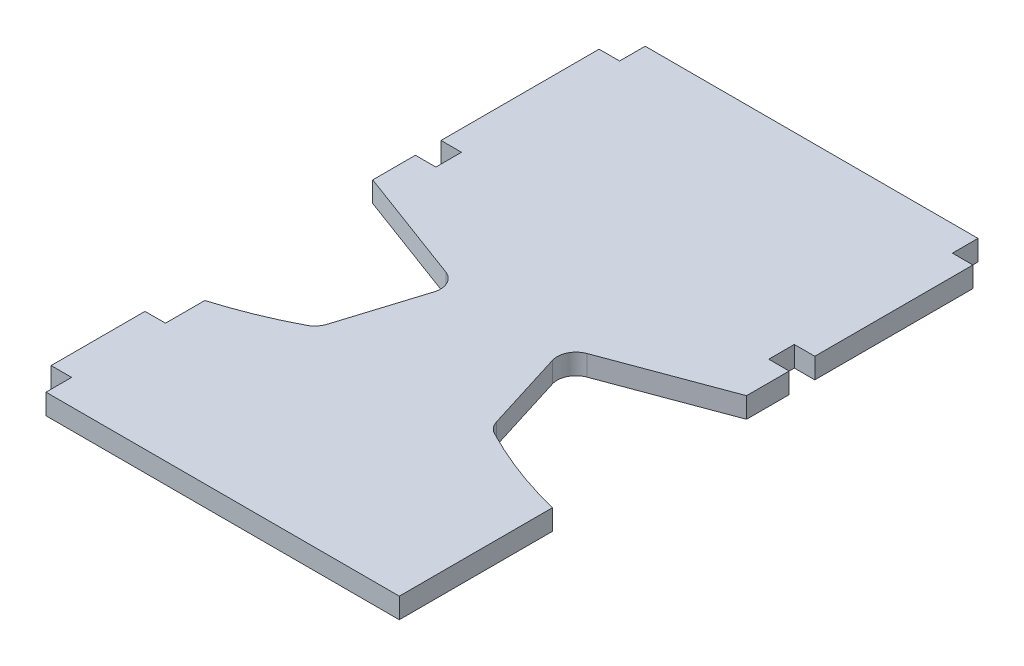
ISO-10303-21;
HEADER;
FILE_DESCRIPTION(('STEP AP214'),'2;1');
FILE_NAME('part.step','',(''),(''),'','','');
FILE_SCHEMA(('AUTOMOTIVE_DESIGN { 1 0 10303 214 1 1 1 1 }'));
ENDSEC;
DATA;
#1=APPLICATION_CONTEXT('core data for automotive mechanical design processes');
#2=APPLICATION_PROTOCOL_DEFINITION('international standard','automotive_design',2000,#1);
#3=PRODUCT_CONTEXT('',#1,'mechanical');
#4=PRODUCT('Part','Part','',(#3));
#5=PRODUCT_RELATED_PRODUCT_CATEGORY('part','',(#4));
#6=PRODUCT_DEFINITION_FORMATION('','',#4);
#7=PRODUCT_DEFINITION_CONTEXT('part definition',#1,'design');
#8=PRODUCT_DEFINITION('design','',#6,#7);
#9=PRODUCT_DEFINITION_SHAPE('','',#8);
#10=(LENGTH_UNIT() NAMED_UNIT(*) SI_UNIT(.MILLI.,.METRE.));
#11=(NAMED_UNIT(*) PLANE_ANGLE_UNIT() SI_UNIT($,.RADIAN.));
#12=(NAMED_UNIT(*) SI_UNIT($,.STERADIAN.) SOLID_ANGLE_UNIT());
#13=UNCERTAINTY_MEASURE_WITH_UNIT(LENGTH_MEASURE(1.E-05),#10,'distance_accuracy_value','');
#14=(GEOMETRIC_REPRESENTATION_CONTEXT(3) GLOBAL_UNCERTAINTY_ASSIGNED_CONTEXT((#13)) GLOBAL_UNIT_ASSIGNED_CONTEXT((#10,
#11,#12)) REPRESENTATION_CONTEXT('',''));
#15=CARTESIAN_POINT('',(0.,0.,0.));
#16=DIRECTION('',(0.,0.,1.));
#17=DIRECTION('',(1.,0.,0.));
#18=AXIS2_PLACEMENT_3D('',#15,#16,#17);
#19=CARTESIAN_POINT('',(55.626,3.048,87.022365809496));
#20=DIRECTION('',(-1.,0.,0.));
#21=DIRECTION('',(0.,0.,1.));
#22=AXIS2_PLACEMENT_3D('',#19,#20,#21);
#23=PLANE('',#22);
#24=DIRECTION('',(0.,0.,-1.));
#25=VECTOR('',#24,1.);
#26=CARTESIAN_POINT('',(55.626,-3.048,87.022365809496));
#27=LINE('',#26,#25);
#28=CARTESIAN_POINT('',(55.626,-3.048,132.617292876109));
#29=VERTEX_POINT('',#28);
#30=CARTESIAN_POINT('',(55.626,-3.048,87.0223658094959));
#31=VERTEX_POINT('',#30);
#32=EDGE_CURVE('E273',#29,#31,#27,.T.);
#33=ORIENTED_EDGE('',*,*,#32,.T.);
#34=DIRECTION('',(0.,-1.,0.));
#35=VECTOR('',#34,1.);
#36=CARTESIAN_POINT('',(55.626,3.048,87.0223658094959));
#37=LINE('',#36,#35);
#38=CARTESIAN_POINT('',(55.626,3.048,87.0223658094959));
#39=VERTEX_POINT('',#38);
#40=EDGE_CURVE('E11',#39,#31,#37,.T.);
#41=ORIENTED_EDGE('',*,*,#40,.F.);
#42=DIRECTION('',(0.,0.,-1.));
#43=VECTOR('',#42,1.);
#44=CARTESIAN_POINT('',(55.626,3.048,87.022365809496));
#45=LINE('',#44,#43);
#46=CARTESIAN_POINT('',(55.626,3.048,132.617292876109));
#47=VERTEX_POINT('',#46);
#48=EDGE_CURVE('E335',#47,#39,#45,.T.);
#49=ORIENTED_EDGE('',*,*,#48,.F.);
#50=DIRECTION('',(0.,-1.,0.));
#51=VECTOR('',#50,1.);
#52=CARTESIAN_POINT('',(55.626,3.048,132.617292876109));
#53=LINE('',#52,#51);
#54=EDGE_CURVE('E269',#47,#29,#53,.T.);
#55=ORIENTED_EDGE('',*,*,#54,.T.);
#56=EDGE_LOOP('',(#33,#41,#49,#55));
#57=FACE_BOUND('',#56,.T.);
#58=ADVANCED_FACE('F33',(#57),#23,.F.);
#59=CARTESIAN_POINT('',(85.09,3.048,-33.02));
#60=DIRECTION('',(0.,-1.,0.));
#61=DIRECTION('',(0.,0.,-1.));
#62=AXIS2_PLACEMENT_3D('',#59,#60,#61);
#63=CYLINDRICAL_SURFACE('',#62,123.605407993101);
#64=CARTESIAN_POINT('',(85.09,-3.048,-33.02));
#65=DIRECTION('',(0.,-1.,0.));
#66=DIRECTION('',(0.,0.,1.));
#67=AXIS2_PLACEMENT_3D('',#64,#65,#66);
#68=CIRCLE('',#67,123.605407993101);
#69=CARTESIAN_POINT('',(27.9390638776405,-3.048,76.5795774876839));
#70=VERTEX_POINT('',#69);
#71=EDGE_CURVE('E276',#31,#70,#68,.T.);
#72=ORIENTED_EDGE('',*,*,#71,.T.);
#73=DIRECTION('',(0.,-1.,0.));
#74=VECTOR('',#73,1.);
#75=CARTESIAN_POINT('',(27.9390638776405,3.048,76.5795774876839));
#76=LINE('',#75,#74);
#77=CARTESIAN_POINT('',(27.9390638776405,3.048,76.5795774876839));
#78=VERTEX_POINT('',#77);
#79=EDGE_CURVE('E41',#78,#70,#76,.T.);
#80=ORIENTED_EDGE('',*,*,#79,.F.);
#81=CARTESIAN_POINT('',(85.09,3.048,-33.02));
#82=DIRECTION('',(0.,-1.,0.));
#83=DIRECTION('',(0.,0.,1.));
#84=AXIS2_PLACEMENT_3D('',#81,#82,#83);
#85=CIRCLE('',#84,123.605407993101);
#86=EDGE_CURVE('E164',#39,#78,#85,.T.);
#87=ORIENTED_EDGE('',*,*,#86,.F.);
#88=ORIENTED_EDGE('',*,*,#40,.T.);
#89=EDGE_LOOP('',(#72,#80,#87,#88));
#90=FACE_BOUND('',#89,.T.);
#91=ADVANCED_FACE('F513',(#90),#63,.F.);
#92=CARTESIAN_POINT('',(30.5227649974942,3.048,71.6247583665386));
#93=DIRECTION('',(0.,-1.,0.));
#94=DIRECTION('',(0.,0.,-1.));
#95=AXIS2_PLACEMENT_3D('',#92,#93,#94);
#96=CYLINDRICAL_SURFACE('',#95,5.588);
#97=CARTESIAN_POINT('',(30.5227649974942,-3.048,71.6247583665386));
#98=DIRECTION('',(0.,-1.,0.));
#99=DIRECTION('',(0.,0.,1.));
#100=AXIS2_PLACEMENT_3D('',#97,#98,#99);
#101=CIRCLE('',#100,5.588);
#102=CARTESIAN_POINT('',(25.187729855607,-3.048,73.2870291130867));
#103=VERTEX_POINT('',#102);
#104=EDGE_CURVE('E278',#70,#103,#101,.T.);
#105=ORIENTED_EDGE('',*,*,#104,.T.);
#106=DIRECTION('',(0.,-1.,0.));
#107=VECTOR('',#106,1.);
#108=CARTESIAN_POINT('',(25.187729855607,3.048,73.2870291130867));
#109=LINE('',#108,#107);
#110=CARTESIAN_POINT('',(25.187729855607,3.048,73.2870291130867));
#111=VERTEX_POINT('',#110);
#112=EDGE_CURVE('E414',#111,#103,#109,.T.);
#113=ORIENTED_EDGE('',*,*,#112,.F.);
#114=CARTESIAN_POINT('',(30.5227649974942,3.048,71.6247583665386));
#115=DIRECTION('',(0.,-1.,0.));
#116=DIRECTION('',(0.,0.,1.));
#117=AXIS2_PLACEMENT_3D('',#114,#115,#116);
#118=CIRCLE('',#117,5.588);
#119=EDGE_CURVE('E422',#78,#111,#118,.T.);
#120=ORIENTED_EDGE('',*,*,#119,.F.);
#121=ORIENTED_EDGE('',*,*,#79,.T.);
#122=EDGE_LOOP('',(#105,#113,#120,#121));
#123=FACE_BOUND('',#122,.T.);
#124=ADVANCED_FACE('F420',(#123),#96,.F.);
#125=CARTESIAN_POINT('',(17.6319537349341,3.048,49.0368693772361));
#126=DIRECTION('',(-0.954730698261834,0.,0.297471500813893));
#127=DIRECTION('',(0.297471500813893,0.,0.954730698261835));
#128=AXIS2_PLACEMENT_3D('',#125,#126,#127);
#129=PLANE('',#128);
#130=DIRECTION('',(-0.297471500813893,0.,-0.954730698261834));
#131=VECTOR('',#130,1.);
#132=CARTESIAN_POINT('',(17.6319537349341,-3.048,49.0368693772361));
#133=LINE('',#132,#131);
#134=CARTESIAN_POINT('',(17.6319537349341,-3.048,49.0368693772361));
#135=VERTEX_POINT('',#134);
#136=EDGE_CURVE('E280',#103,#135,#133,.T.);
#137=ORIENTED_EDGE('',*,*,#136,.T.);
#138=DIRECTION('',(0.,-1.,0.));
#139=VECTOR('',#138,1.);
#140=CARTESIAN_POINT('',(17.6319537349341,3.048,49.0368693772361));
#141=LINE('',#140,#139);
#142=CARTESIAN_POINT('',(17.6319537349341,3.048,49.0368693772361));
#143=VERTEX_POINT('',#142);
#144=EDGE_CURVE('E411',#143,#135,#141,.T.);
#145=ORIENTED_EDGE('',*,*,#144,.F.);
#146=DIRECTION('',(-0.297471500813893,0.,-0.954730698261834));
#147=VECTOR('',#146,1.);
#148=CARTESIAN_POINT('',(17.6319537349341,3.048,49.0368693772361));
#149=LINE('',#148,#147);
#150=EDGE_CURVE('E440',#111,#143,#149,.T.);
#151=ORIENTED_EDGE('',*,*,#150,.F.);
#152=ORIENTED_EDGE('',*,*,#112,.T.);
#153=EDGE_LOOP('',(#137,#145,#151,#152));
#154=FACE_BOUND('',#153,.T.);
#155=ADVANCED_FACE('F431',(#154),#129,.F.);
#156=CARTESIAN_POINT('',(22.9669888768213,3.048,47.374598630688));
#157=DIRECTION('',(0.,-1.,0.));
#158=DIRECTION('',(0.,0.,-1.));
#159=AXIS2_PLACEMENT_3D('',#156,#157,#158);
#160=CYLINDRICAL_SURFACE('',#159,5.588);
#161=CARTESIAN_POINT('',(22.9669888768213,-3.048,47.374598630688));
#162=DIRECTION('',(0.,-1.,0.));
#163=DIRECTION('',(0.,0.,1.));
#164=AXIS2_PLACEMENT_3D('',#161,#162,#163);
#165=CIRCLE('',#164,5.588);
#166=CARTESIAN_POINT('',(21.0198271357508,-3.048,42.1368218929766));
#167=VERTEX_POINT('',#166);
#168=EDGE_CURVE('E282',#135,#167,#165,.T.);
#169=ORIENTED_EDGE('',*,*,#168,.T.);
#170=DIRECTION('',(0.,-1.,0.));
#171=VECTOR('',#170,1.);
#172=CARTESIAN_POINT('',(21.0198271357508,3.048,42.1368218929766));
#173=LINE('',#172,#171);
#174=CARTESIAN_POINT('',(21.0198271357508,3.048,42.1368218929766));
#175=VERTEX_POINT('',#174);
#176=EDGE_CURVE('E408',#175,#167,#173,.T.);
#177=ORIENTED_EDGE('',*,*,#176,.F.);
#178=CARTESIAN_POINT('',(22.9669888768213,3.048,47.374598630688));
#179=DIRECTION('',(0.,-1.,0.));
#180=DIRECTION('',(0.,0.,1.));
#181=AXIS2_PLACEMENT_3D('',#178,#179,#180);
#182=CIRCLE('',#181,5.588);
#183=EDGE_CURVE('E437',#143,#175,#182,.T.);
#184=ORIENTED_EDGE('',*,*,#183,.F.);
#185=ORIENTED_EDGE('',*,*,#144,.T.);
#186=EDGE_LOOP('',(#169,#177,#184,#185));
#187=FACE_BOUND('',#186,.T.);
#188=ADVANCED_FACE('F435',(#187),#160,.F.);
#189=CARTESIAN_POINT('',(55.626,3.048,29.2718566261337));
#190=DIRECTION('',(-0.348454141208024,0.,-0.93732582994121));
#191=DIRECTION('',(-0.93732582994121,0.,0.348454141208024));
#192=AXIS2_PLACEMENT_3D('',#189,#190,#191);
#193=PLANE('',#192);
#194=DIRECTION('',(0.93732582994121,0.,-0.348454141208024));
#195=VECTOR('',#194,1.);
#196=CARTESIAN_POINT('',(55.626,-3.048,29.2718566261337));
#197=LINE('',#196,#195);
#198=CARTESIAN_POINT('',(55.626,-3.048,29.2718566261337));
#199=VERTEX_POINT('',#198);
#200=EDGE_CURVE('E284',#167,#199,#197,.T.);
#201=ORIENTED_EDGE('',*,*,#200,.T.);
#202=DIRECTION('',(0.,-1.,0.));
#203=VECTOR('',#202,1.);
#204=CARTESIAN_POINT('',(55.626,3.048,29.2718566261337));
#205=LINE('',#204,#203);
#206=CARTESIAN_POINT('',(55.626,3.048,29.2718566261337));
#207=VERTEX_POINT('',#206);
#208=EDGE_CURVE('E405',#207,#199,#205,.T.);
#209=ORIENTED_EDGE('',*,*,#208,.F.);
#210=DIRECTION('',(0.93732582994121,0.,-0.348454141208024));
#211=VECTOR('',#210,1.);
#212=CARTESIAN_POINT('',(55.626,3.048,29.2718566261337));
#213=LINE('',#212,#211);
#214=EDGE_CURVE('E439',#175,#207,#213,.T.);
#215=ORIENTED_EDGE('',*,*,#214,.F.);
#216=ORIENTED_EDGE('',*,*,#176,.T.);
#217=EDGE_LOOP('',(#201,#209,#215,#216));
#218=FACE_BOUND('',#217,.T.);
#219=ADVANCED_FACE('F526',(#218),#193,.F.);
#220=CARTESIAN_POINT('',(55.626,3.048,16.5718566261337));
#221=DIRECTION('',(-1.,0.,0.));
#222=DIRECTION('',(0.,0.,1.));
#223=AXIS2_PLACEMENT_3D('',#220,#221,#222);
#224=PLANE('',#223);
#225=DIRECTION('',(0.,0.,-1.));
#226=VECTOR('',#225,1.);
#227=CARTESIAN_POINT('',(55.626,-3.048,16.5718566261337));
#228=LINE('',#227,#226);
#229=CARTESIAN_POINT('',(55.626,-3.048,16.5718566261337));
#230=VERTEX_POINT('',#229);
#231=EDGE_CURVE('E286',#199,#230,#228,.T.);
#232=ORIENTED_EDGE('',*,*,#231,.T.);
#233=DIRECTION('',(0.,-1.,0.));
#234=VECTOR('',#233,1.);
#235=CARTESIAN_POINT('',(55.626,3.048,16.5718566261337));
#236=LINE('',#235,#234);
#237=CARTESIAN_POINT('',(55.626,3.048,16.5718566261337));
#238=VERTEX_POINT('',#237);
#239=EDGE_CURVE('E402',#238,#230,#236,.T.);
#240=ORIENTED_EDGE('',*,*,#239,.F.);
#241=DIRECTION('',(0.,0.,-1.));
#242=VECTOR('',#241,1.);
#243=CARTESIAN_POINT('',(55.626,3.048,16.5718566261337));
#244=LINE('',#243,#242);
#245=EDGE_CURVE('E442',#207,#238,#244,.T.);
#246=ORIENTED_EDGE('',*,*,#245,.F.);
#247=ORIENTED_EDGE('',*,*,#208,.T.);
#248=EDGE_LOOP('',(#232,#240,#246,#247));
#249=FACE_BOUND('',#248,.T.);
#250=ADVANCED_FACE('F529',(#249),#224,.F.);
#251=CARTESIAN_POINT('',(55.626,3.048,16.5718566261337));
#252=DIRECTION('',(0.,0.,1.));
#253=DIRECTION('',(1.,0.,0.));
#254=AXIS2_PLACEMENT_3D('',#251,#252,#253);
#255=PLANE('',#254);
#256=DIRECTION('',(-1.,0.,0.));
#257=VECTOR('',#256,1.);
#258=CARTESIAN_POINT('',(55.626,-3.048,16.5718566261337));
#259=LINE('',#258,#257);
#260=CARTESIAN_POINT('',(49.53,-3.048,16.5718566261337));
#261=VERTEX_POINT('',#260);
#262=EDGE_CURVE('E288',#230,#261,#259,.T.);
#263=ORIENTED_EDGE('',*,*,#262,.T.);
#264=DIRECTION('',(0.,-1.,0.));
#265=VECTOR('',#264,1.);
#266=CARTESIAN_POINT('',(49.53,3.048,16.5718566261337));
#267=LINE('',#266,#265);
#268=CARTESIAN_POINT('',(49.53,3.048,16.5718566261337));
#269=VERTEX_POINT('',#268);
#270=EDGE_CURVE('E399',#269,#261,#267,.T.);
#271=ORIENTED_EDGE('',*,*,#270,.F.);
#272=DIRECTION('',(-1.,0.,0.));
#273=VECTOR('',#272,1.);
#274=CARTESIAN_POINT('',(55.626,3.048,16.5718566261337));
#275=LINE('',#274,#273);
#276=EDGE_CURVE('E448',#238,#269,#275,.T.);
#277=ORIENTED_EDGE('',*,*,#276,.F.);
#278=ORIENTED_EDGE('',*,*,#239,.T.);
#279=EDGE_LOOP('',(#263,#271,#277,#278));
#280=FACE_BOUND('',#279,.T.);
#281=ADVANCED_FACE('F533',(#280),#255,.F.);
#282=CARTESIAN_POINT('',(49.53,3.048,16.5718566261337));
#283=DIRECTION('',(-1.,0.,0.));
#284=DIRECTION('',(0.,0.,1.));
#285=AXIS2_PLACEMENT_3D('',#282,#283,#284);
#286=PLANE('',#285);
#287=DIRECTION('',(0.,0.,-1.));
#288=VECTOR('',#287,1.);
#289=CARTESIAN_POINT('',(49.53,-3.048,16.5718566261337));
#290=LINE('',#289,#288);
#291=CARTESIAN_POINT('',(49.53,-3.048,8.95185662613366));
#292=VERTEX_POINT('',#291);
#293=EDGE_CURVE('E290',#261,#292,#290,.T.);
#294=ORIENTED_EDGE('',*,*,#293,.T.);
#295=DIRECTION('',(0.,-1.,0.));
#296=VECTOR('',#295,1.);
#297=CARTESIAN_POINT('',(49.53,3.048,8.95185662613366));
#298=LINE('',#297,#296);
#299=CARTESIAN_POINT('',(49.53,3.048,8.95185662613366));
#300=VERTEX_POINT('',#299);
#301=EDGE_CURVE('E396',#300,#292,#298,.T.);
#302=ORIENTED_EDGE('',*,*,#301,.F.);
#303=DIRECTION('',(0.,0.,-1.));
#304=VECTOR('',#303,1.);
#305=CARTESIAN_POINT('',(49.53,3.048,16.5718566261337));
#306=LINE('',#305,#304);
#307=EDGE_CURVE('E450',#269,#300,#306,.T.);
#308=ORIENTED_EDGE('',*,*,#307,.F.);
#309=ORIENTED_EDGE('',*,*,#270,.T.);
#310=EDGE_LOOP('',(#294,#302,#308,#309));
#311=FACE_BOUND('',#310,.T.);
#312=ADVANCED_FACE('F537',(#311),#286,.F.);
#313=CARTESIAN_POINT('',(55.626,3.048,8.95185662613365));
#314=DIRECTION('',(0.,0.,-1.));
#315=DIRECTION('',(-1.,0.,0.));
#316=AXIS2_PLACEMENT_3D('',#313,#314,#315);
#317=PLANE('',#316);
#318=DIRECTION('',(1.,0.,0.));
#319=VECTOR('',#318,1.);
#320=CARTESIAN_POINT('',(55.626,-3.048,8.95185662613365));
#321=LINE('',#320,#319);
#322=CARTESIAN_POINT('',(55.626,-3.048,8.95185662613365));
#323=VERTEX_POINT('',#322);
#324=EDGE_CURVE('E292',#292,#323,#321,.T.);
#325=ORIENTED_EDGE('',*,*,#324,.T.);
#326=DIRECTION('',(0.,-1.,0.));
#327=VECTOR('',#326,1.);
#328=CARTESIAN_POINT('',(55.626,3.048,8.95185662613365));
#329=LINE('',#328,#327);
#330=CARTESIAN_POINT('',(55.626,3.048,8.95185662613365));
#331=VERTEX_POINT('',#330);
#332=EDGE_CURVE('E393',#331,#323,#329,.T.);
#333=ORIENTED_EDGE('',*,*,#332,.F.);
#334=DIRECTION('',(1.,0.,0.));
#335=VECTOR('',#334,1.);
#336=CARTESIAN_POINT('',(55.626,3.048,8.95185662613365));
#337=LINE('',#336,#335);
#338=EDGE_CURVE('E452',#300,#331,#337,.T.);
#339=ORIENTED_EDGE('',*,*,#338,.F.);
#340=ORIENTED_EDGE('',*,*,#301,.T.);
#341=EDGE_LOOP('',(#325,#333,#339,#340));
#342=FACE_BOUND('',#341,.T.);
#343=ADVANCED_FACE('F541',(#342),#317,.F.);
#344=CARTESIAN_POINT('',(55.626,3.048,-38.1));
#345=DIRECTION('',(-1.,0.,0.));
#346=DIRECTION('',(0.,0.,1.));
#347=AXIS2_PLACEMENT_3D('',#344,#345,#346);
#348=PLANE('',#347);
#349=DIRECTION('',(0.,0.,-1.));
#350=VECTOR('',#349,1.);
#351=CARTESIAN_POINT('',(55.626,-3.048,-38.1));
#352=LINE('',#351,#350);
#353=CARTESIAN_POINT('',(55.626,-3.048,-38.1));
#354=VERTEX_POINT('',#353);
#355=EDGE_CURVE('E294',#323,#354,#352,.T.);
#356=ORIENTED_EDGE('',*,*,#355,.T.);
#357=DIRECTION('',(0.,-1.,0.));
#358=VECTOR('',#357,1.);
#359=CARTESIAN_POINT('',(55.626,3.048,-38.1));
#360=LINE('',#359,#358);
#361=CARTESIAN_POINT('',(55.626,3.048,-38.1));
#362=VERTEX_POINT('',#361);
#363=EDGE_CURVE('E390',#362,#354,#360,.T.);
#364=ORIENTED_EDGE('',*,*,#363,.F.);
#365=DIRECTION('',(0.,0.,-1.));
#366=VECTOR('',#365,1.);
#367=CARTESIAN_POINT('',(55.626,3.048,-38.1));
#368=LINE('',#367,#366);
#369=EDGE_CURVE('E454',#331,#362,#368,.T.);
#370=ORIENTED_EDGE('',*,*,#369,.F.);
#371=ORIENTED_EDGE('',*,*,#332,.T.);
#372=EDGE_LOOP('',(#356,#364,#370,#371));
#373=FACE_BOUND('',#372,.T.);
#374=ADVANCED_FACE('F545',(#373),#348,.F.);
#375=CARTESIAN_POINT('',(55.626,3.048,-38.1));
#376=DIRECTION('',(0.,0.,1.));
#377=DIRECTION('',(1.,0.,0.));
#378=AXIS2_PLACEMENT_3D('',#375,#376,#377);
#379=PLANE('',#378);
#380=DIRECTION('',(-1.,0.,0.));
#381=VECTOR('',#380,1.);
#382=CARTESIAN_POINT('',(55.626,-3.048,-38.1));
#383=LINE('',#382,#381);
#384=CARTESIAN_POINT('',(49.53,-3.048,-38.1));
#385=VERTEX_POINT('',#384);
#386=EDGE_CURVE('E296',#354,#385,#383,.T.);
#387=ORIENTED_EDGE('',*,*,#386,.T.);
#388=DIRECTION('',(0.,-1.,0.));
#389=VECTOR('',#388,1.);
#390=CARTESIAN_POINT('',(49.53,3.048,-38.1));
#391=LINE('',#390,#389);
#392=CARTESIAN_POINT('',(49.53,3.048,-38.1));
#393=VERTEX_POINT('',#392);
#394=EDGE_CURVE('E387',#393,#385,#391,.T.);
#395=ORIENTED_EDGE('',*,*,#394,.F.);
#396=DIRECTION('',(-1.,0.,0.));
#397=VECTOR('',#396,1.);
#398=CARTESIAN_POINT('',(55.626,3.048,-38.1));
#399=LINE('',#398,#397);
#400=EDGE_CURVE('E456',#362,#393,#399,.T.);
#401=ORIENTED_EDGE('',*,*,#400,.F.);
#402=ORIENTED_EDGE('',*,*,#363,.T.);
#403=EDGE_LOOP('',(#387,#395,#401,#402));
#404=FACE_BOUND('',#403,.T.);
#405=ADVANCED_FACE('F549',(#404),#379,.F.);
#406=CARTESIAN_POINT('',(49.53,3.048,-45.72));
#407=DIRECTION('',(-1.,0.,0.));
#408=DIRECTION('',(0.,0.,1.));
#409=AXIS2_PLACEMENT_3D('',#406,#407,#408);
#410=PLANE('',#409);
#411=DIRECTION('',(0.,0.,-1.));
#412=VECTOR('',#411,1.);
#413=CARTESIAN_POINT('',(49.53,-3.048,-45.72));
#414=LINE('',#413,#412);
#415=CARTESIAN_POINT('',(49.53,-3.048,-45.72));
#416=VERTEX_POINT('',#415);
#417=EDGE_CURVE('E298',#385,#416,#414,.T.);
#418=ORIENTED_EDGE('',*,*,#417,.T.);
#419=DIRECTION('',(0.,-1.,0.));
#420=VECTOR('',#419,1.);
#421=CARTESIAN_POINT('',(49.53,3.048,-45.72));
#422=LINE('',#421,#420);
#423=CARTESIAN_POINT('',(49.53,3.048,-45.72));
#424=VERTEX_POINT('',#423);
#425=EDGE_CURVE('E384',#424,#416,#422,.T.);
#426=ORIENTED_EDGE('',*,*,#425,.F.);
#427=DIRECTION('',(0.,0.,-1.));
#428=VECTOR('',#427,1.);
#429=CARTESIAN_POINT('',(49.53,3.048,-45.72));
#430=LINE('',#429,#428);
#431=EDGE_CURVE('E458',#393,#424,#430,.T.);
#432=ORIENTED_EDGE('',*,*,#431,.F.);
#433=ORIENTED_EDGE('',*,*,#394,.T.);
#434=EDGE_LOOP('',(#418,#426,#432,#433));
#435=FACE_BOUND('',#434,.T.);
#436=ADVANCED_FACE('F553',(#435),#410,.F.);
#437=CARTESIAN_POINT('',(-49.53,3.048,-45.72));
#438=DIRECTION('',(0.,0.,1.));
#439=DIRECTION('',(1.,0.,0.));
#440=AXIS2_PLACEMENT_3D('',#437,#438,#439);
#441=PLANE('',#440);
#442=DIRECTION('',(-1.,0.,0.));
#443=VECTOR('',#442,1.);
#444=CARTESIAN_POINT('',(-49.53,-3.048,-45.72));
#445=LINE('',#444,#443);
#446=CARTESIAN_POINT('',(-49.53,-3.048,-45.72));
#447=VERTEX_POINT('',#446);
#448=EDGE_CURVE('E300',#416,#447,#445,.T.);
#449=ORIENTED_EDGE('',*,*,#448,.T.);
#450=DIRECTION('',(0.,-1.,0.));
#451=VECTOR('',#450,1.);
#452=CARTESIAN_POINT('',(-49.53,3.048,-45.72));
#453=LINE('',#452,#451);
#454=CARTESIAN_POINT('',(-49.53,3.048,-45.72));
#455=VERTEX_POINT('',#454);
#456=EDGE_CURVE('E381',#455,#447,#453,.T.);
#457=ORIENTED_EDGE('',*,*,#456,.F.);
#458=DIRECTION('',(-1.,0.,0.));
#459=VECTOR('',#458,1.);
#460=CARTESIAN_POINT('',(-49.53,3.048,-45.72));
#461=LINE('',#460,#459);
#462=EDGE_CURVE('E460',#424,#455,#461,.T.);
#463=ORIENTED_EDGE('',*,*,#462,.F.);
#464=ORIENTED_EDGE('',*,*,#425,.T.);
#465=EDGE_LOOP('',(#449,#457,#463,#464));
#466=FACE_BOUND('',#465,.T.);
#467=ADVANCED_FACE('F557',(#466),#441,.F.);
#468=CARTESIAN_POINT('',(-49.53,3.048,-38.1));
#469=DIRECTION('',(1.,0.,0.));
#470=DIRECTION('',(0.,0.,-1.));
#471=AXIS2_PLACEMENT_3D('',#468,#469,#470);
#472=PLANE('',#471);
#473=DIRECTION('',(0.,0.,1.));
#474=VECTOR('',#473,1.);
#475=CARTESIAN_POINT('',(-49.53,-3.048,-38.1));
#476=LINE('',#475,#474);
#477=CARTESIAN_POINT('',(-49.53,-3.048,-38.1));
#478=VERTEX_POINT('',#477);
#479=EDGE_CURVE('E302',#447,#478,#476,.T.);
#480=ORIENTED_EDGE('',*,*,#479,.T.);
#481=DIRECTION('',(0.,-1.,0.));
#482=VECTOR('',#481,1.);
#483=CARTESIAN_POINT('',(-49.53,3.048,-38.1));
#484=LINE('',#483,#482);
#485=CARTESIAN_POINT('',(-49.53,3.048,-38.1));
#486=VERTEX_POINT('',#485);
#487=EDGE_CURVE('E378',#486,#478,#484,.T.);
#488=ORIENTED_EDGE('',*,*,#487,.F.);
#489=DIRECTION('',(0.,0.,1.));
#490=VECTOR('',#489,1.);
#491=CARTESIAN_POINT('',(-49.53,3.048,-38.1));
#492=LINE('',#491,#490);
#493=EDGE_CURVE('E462',#455,#486,#492,.T.);
#494=ORIENTED_EDGE('',*,*,#493,.F.);
#495=ORIENTED_EDGE('',*,*,#456,.T.);
#496=EDGE_LOOP('',(#480,#488,#494,#495));
#497=FACE_BOUND('',#496,.T.);
#498=ADVANCED_FACE('F561',(#497),#472,.F.);
#499=CARTESIAN_POINT('',(-49.53,3.048,-38.1));
#500=DIRECTION('',(0.,0.,1.));
#501=DIRECTION('',(1.,0.,0.));
#502=AXIS2_PLACEMENT_3D('',#499,#500,#501);
#503=PLANE('',#502);
#504=DIRECTION('',(-1.,0.,0.));
#505=VECTOR('',#504,1.);
#506=CARTESIAN_POINT('',(-49.53,-3.048,-38.1));
#507=LINE('',#506,#505);
#508=CARTESIAN_POINT('',(-55.626,-3.048,-38.1));
#509=VERTEX_POINT('',#508);
#510=EDGE_CURVE('E304',#478,#509,#507,.T.);
#511=ORIENTED_EDGE('',*,*,#510,.T.);
#512=DIRECTION('',(0.,-1.,0.));
#513=VECTOR('',#512,1.);
#514=CARTESIAN_POINT('',(-55.626,3.048,-38.1));
#515=LINE('',#514,#513);
#516=CARTESIAN_POINT('',(-55.626,3.048,-38.1));
#517=VERTEX_POINT('',#516);
#518=EDGE_CURVE('E375',#517,#509,#515,.T.);
#519=ORIENTED_EDGE('',*,*,#518,.F.);
#520=DIRECTION('',(-1.,0.,0.));
#521=VECTOR('',#520,1.);
#522=CARTESIAN_POINT('',(-49.53,3.048,-38.1));
#523=LINE('',#522,#521);
#524=EDGE_CURVE('E464',#486,#517,#523,.T.);
#525=ORIENTED_EDGE('',*,*,#524,.F.);
#526=ORIENTED_EDGE('',*,*,#487,.T.);
#527=EDGE_LOOP('',(#511,#519,#525,#526));
#528=FACE_BOUND('',#527,.T.);
#529=ADVANCED_FACE('F565',(#528),#503,.F.);
#530=CARTESIAN_POINT('',(-55.626,3.048,-38.1));
#531=DIRECTION('',(1.,0.,0.));
#532=DIRECTION('',(0.,0.,-1.));
#533=AXIS2_PLACEMENT_3D('',#530,#531,#532);
#534=PLANE('',#533);
#535=DIRECTION('',(0.,0.,1.));
#536=VECTOR('',#535,1.);
#537=CARTESIAN_POINT('',(-55.626,-3.048,-38.1));
#538=LINE('',#537,#536);
#539=CARTESIAN_POINT('',(-55.626,-3.048,8.95185662613366));
#540=VERTEX_POINT('',#539);
#541=EDGE_CURVE('E306',#509,#540,#538,.T.);
#542=ORIENTED_EDGE('',*,*,#541,.T.);
#543=DIRECTION('',(0.,-1.,0.));
#544=VECTOR('',#543,1.);
#545=CARTESIAN_POINT('',(-55.626,3.048,8.95185662613366));
#546=LINE('',#545,#544);
#547=CARTESIAN_POINT('',(-55.626,3.048,8.95185662613366));
#548=VERTEX_POINT('',#547);
#549=EDGE_CURVE('E372',#548,#540,#546,.T.);
#550=ORIENTED_EDGE('',*,*,#549,.F.);
#551=DIRECTION('',(0.,0.,1.));
#552=VECTOR('',#551,1.);
#553=CARTESIAN_POINT('',(-55.626,3.048,-38.1));
#554=LINE('',#553,#552);
#555=EDGE_CURVE('E466',#517,#548,#554,.T.);
#556=ORIENTED_EDGE('',*,*,#555,.F.);
#557=ORIENTED_EDGE('',*,*,#518,.T.);
#558=EDGE_LOOP('',(#542,#550,#556,#557));
#559=FACE_BOUND('',#558,.T.);
#560=ADVANCED_FACE('F569',(#559),#534,.F.);
#561=CARTESIAN_POINT('',(-49.53,3.048,8.95185662613366));
#562=DIRECTION('',(0.,0.,-1.));
#563=DIRECTION('',(-1.,0.,0.));
#564=AXIS2_PLACEMENT_3D('',#561,#562,#563);
#565=PLANE('',#564);
#566=DIRECTION('',(1.,0.,0.));
#567=VECTOR('',#566,1.);
#568=CARTESIAN_POINT('',(-49.53,-3.048,8.95185662613366));
#569=LINE('',#568,#567);
#570=CARTESIAN_POINT('',(-49.53,-3.048,8.95185662613366));
#571=VERTEX_POINT('',#570);
#572=EDGE_CURVE('E308',#540,#571,#569,.T.);
#573=ORIENTED_EDGE('',*,*,#572,.T.);
#574=DIRECTION('',(0.,-1.,0.));
#575=VECTOR('',#574,1.);
#576=CARTESIAN_POINT('',(-49.53,3.048,8.95185662613366));
#577=LINE('',#576,#575);
#578=CARTESIAN_POINT('',(-49.53,3.048,8.95185662613366));
#579=VERTEX_POINT('',#578);
#580=EDGE_CURVE('E369',#579,#571,#577,.T.);
#581=ORIENTED_EDGE('',*,*,#580,.F.);
#582=DIRECTION('',(1.,0.,0.));
#583=VECTOR('',#582,1.);
#584=CARTESIAN_POINT('',(-49.53,3.048,8.95185662613366));
#585=LINE('',#584,#583);
#586=EDGE_CURVE('E468',#548,#579,#585,.T.);
#587=ORIENTED_EDGE('',*,*,#586,.F.);
#588=ORIENTED_EDGE('',*,*,#549,.T.);
#589=EDGE_LOOP('',(#573,#581,#587,#588));
#590=FACE_BOUND('',#589,.T.);
#591=ADVANCED_FACE('F573',(#590),#565,.F.);
#592=CARTESIAN_POINT('',(-49.53,3.048,8.95185662613366));
#593=DIRECTION('',(1.,0.,0.));
#594=DIRECTION('',(0.,0.,-1.));
#595=AXIS2_PLACEMENT_3D('',#592,#593,#594);
#596=PLANE('',#595);
#597=DIRECTION('',(0.,0.,1.));
#598=VECTOR('',#597,1.);
#599=CARTESIAN_POINT('',(-49.53,-3.048,8.95185662613366));
#600=LINE('',#599,#598);
#601=CARTESIAN_POINT('',(-49.53,-3.048,16.5718566261337));
#602=VERTEX_POINT('',#601);
#603=EDGE_CURVE('E310',#571,#602,#600,.T.);
#604=ORIENTED_EDGE('',*,*,#603,.T.);
#605=DIRECTION('',(0.,-1.,0.));
#606=VECTOR('',#605,1.);
#607=CARTESIAN_POINT('',(-49.53,3.048,16.5718566261337));
#608=LINE('',#607,#606);
#609=CARTESIAN_POINT('',(-49.53,3.048,16.5718566261337));
#610=VERTEX_POINT('',#609);
#611=EDGE_CURVE('E366',#610,#602,#608,.T.);
#612=ORIENTED_EDGE('',*,*,#611,.F.);
#613=DIRECTION('',(0.,0.,1.));
#614=VECTOR('',#613,1.);
#615=CARTESIAN_POINT('',(-49.53,3.048,8.95185662613366));
#616=LINE('',#615,#614);
#617=EDGE_CURVE('E470',#579,#610,#616,.T.);
#618=ORIENTED_EDGE('',*,*,#617,.F.);
#619=ORIENTED_EDGE('',*,*,#580,.T.);
#620=EDGE_LOOP('',(#604,#612,#618,#619));
#621=FACE_BOUND('',#620,.T.);
#622=ADVANCED_FACE('F577',(#621),#596,.F.);
#623=CARTESIAN_POINT('',(-49.53,3.048,16.5718566261337));
#624=DIRECTION('',(0.,0.,1.));
#625=DIRECTION('',(1.,0.,0.));
#626=AXIS2_PLACEMENT_3D('',#623,#624,#625);
#627=PLANE('',#626);
#628=DIRECTION('',(-1.,0.,0.));
#629=VECTOR('',#628,1.);
#630=CARTESIAN_POINT('',(-49.53,-3.048,16.5718566261337));
#631=LINE('',#630,#629);
#632=CARTESIAN_POINT('',(-55.626,-3.048,16.5718566261337));
#633=VERTEX_POINT('',#632);
#634=EDGE_CURVE('E312',#602,#633,#631,.T.);
#635=ORIENTED_EDGE('',*,*,#634,.T.);
#636=DIRECTION('',(0.,-1.,0.));
#637=VECTOR('',#636,1.);
#638=CARTESIAN_POINT('',(-55.626,3.048,16.5718566261337));
#639=LINE('',#638,#637);
#640=CARTESIAN_POINT('',(-55.626,3.048,16.5718566261337));
#641=VERTEX_POINT('',#640);
#642=EDGE_CURVE('E363',#641,#633,#639,.T.);
#643=ORIENTED_EDGE('',*,*,#642,.F.);
#644=DIRECTION('',(-1.,0.,0.));
#645=VECTOR('',#644,1.);
#646=CARTESIAN_POINT('',(-49.53,3.048,16.5718566261337));
#647=LINE('',#646,#645);
#648=EDGE_CURVE('E472',#610,#641,#647,.T.);
#649=ORIENTED_EDGE('',*,*,#648,.F.);
#650=ORIENTED_EDGE('',*,*,#611,.T.);
#651=EDGE_LOOP('',(#635,#643,#649,#650));
#652=FACE_BOUND('',#651,.T.);
#653=ADVANCED_FACE('F581',(#652),#627,.F.);
#654=CARTESIAN_POINT('',(-55.626,3.048,16.5718566261337));
#655=DIRECTION('',(1.,0.,0.));
#656=DIRECTION('',(0.,0.,-1.));
#657=AXIS2_PLACEMENT_3D('',#654,#655,#656);
#658=PLANE('',#657);
#659=DIRECTION('',(0.,0.,1.));
#660=VECTOR('',#659,1.);
#661=CARTESIAN_POINT('',(-55.626,-3.048,16.5718566261337));
#662=LINE('',#661,#660);
#663=CARTESIAN_POINT('',(-55.626,-3.048,29.2718566261337));
#664=VERTEX_POINT('',#663);
#665=EDGE_CURVE('E314',#633,#664,#662,.T.);
#666=ORIENTED_EDGE('',*,*,#665,.T.);
#667=DIRECTION('',(0.,-1.,0.));
#668=VECTOR('',#667,1.);
#669=CARTESIAN_POINT('',(-55.626,3.048,29.2718566261337));
#670=LINE('',#669,#668);
#671=CARTESIAN_POINT('',(-55.626,3.048,29.2718566261337));
#672=VERTEX_POINT('',#671);
#673=EDGE_CURVE('E360',#672,#664,#670,.T.);
#674=ORIENTED_EDGE('',*,*,#673,.F.);
#675=DIRECTION('',(0.,0.,1.));
#676=VECTOR('',#675,1.);
#677=CARTESIAN_POINT('',(-55.626,3.048,16.5718566261337));
#678=LINE('',#677,#676);
#679=EDGE_CURVE('E474',#641,#672,#678,.T.);
#680=ORIENTED_EDGE('',*,*,#679,.F.);
#681=ORIENTED_EDGE('',*,*,#642,.T.);
#682=EDGE_LOOP('',(#666,#674,#680,#681));
#683=FACE_BOUND('',#682,.T.);
#684=ADVANCED_FACE('F585',(#683),#658,.F.);
#685=CARTESIAN_POINT('',(-21.0198271357508,3.048,42.1368218929766));
#686=DIRECTION('',(0.348454141208024,0.,-0.93732582994121));
#687=DIRECTION('',(-0.93732582994121,0.,-0.348454141208024));
#688=AXIS2_PLACEMENT_3D('',#685,#686,#687);
#689=PLANE('',#688);
#690=DIRECTION('',(0.93732582994121,0.,0.348454141208024));
#691=VECTOR('',#690,1.);
#692=CARTESIAN_POINT('',(-21.0198271357508,-3.048,42.1368218929766));
#693=LINE('',#692,#691);
#694=CARTESIAN_POINT('',(-21.0198271357508,-3.048,42.1368218929766));
#695=VERTEX_POINT('',#694);
#696=EDGE_CURVE('E316',#664,#695,#693,.T.);
#697=ORIENTED_EDGE('',*,*,#696,.T.);
#698=DIRECTION('',(0.,-1.,0.));
#699=VECTOR('',#698,1.);
#700=CARTESIAN_POINT('',(-21.0198271357508,3.048,42.1368218929766));
#701=LINE('',#700,#699);
#702=CARTESIAN_POINT('',(-21.0198271357508,3.048,42.1368218929766));
#703=VERTEX_POINT('',#702);
#704=EDGE_CURVE('E357',#703,#695,#701,.T.);
#705=ORIENTED_EDGE('',*,*,#704,.F.);
#706=DIRECTION('',(0.93732582994121,0.,0.348454141208024));
#707=VECTOR('',#706,1.);
#708=CARTESIAN_POINT('',(-21.0198271357508,3.048,42.1368218929766));
#709=LINE('',#708,#707);
#710=EDGE_CURVE('E476',#672,#703,#709,.T.);
#711=ORIENTED_EDGE('',*,*,#710,.F.);
#712=ORIENTED_EDGE('',*,*,#673,.T.);
#713=EDGE_LOOP('',(#697,#705,#711,#712));
#714=FACE_BOUND('',#713,.T.);
#715=ADVANCED_FACE('F589',(#714),#689,.F.);
#716=CARTESIAN_POINT('',(-22.9669888768213,3.048,47.374598630688));
#717=DIRECTION('',(0.,-1.,0.));
#718=DIRECTION('',(0.,0.,-1.));
#719=AXIS2_PLACEMENT_3D('',#716,#717,#718);
#720=CYLINDRICAL_SURFACE('',#719,5.588);
#721=CARTESIAN_POINT('',(-22.9669888768213,-3.048,47.374598630688));
#722=DIRECTION('',(0.,-1.,0.));
#723=DIRECTION('',(0.,0.,1.));
#724=AXIS2_PLACEMENT_3D('',#721,#722,#723);
#725=CIRCLE('',#724,5.588);
#726=CARTESIAN_POINT('',(-17.6319537349341,-3.048,49.0368693772361));
#727=VERTEX_POINT('',#726);
#728=EDGE_CURVE('E318',#695,#727,#725,.T.);
#729=ORIENTED_EDGE('',*,*,#728,.T.);
#730=DIRECTION('',(0.,-1.,0.));
#731=VECTOR('',#730,1.);
#732=CARTESIAN_POINT('',(-17.6319537349341,3.048,49.0368693772361));
#733=LINE('',#732,#731);
#734=CARTESIAN_POINT('',(-17.6319537349341,3.048,49.0368693772361));
#735=VERTEX_POINT('',#734);
#736=EDGE_CURVE('E354',#735,#727,#733,.T.);
#737=ORIENTED_EDGE('',*,*,#736,.F.);
#738=CARTESIAN_POINT('',(-22.9669888768213,3.048,47.374598630688));
#739=DIRECTION('',(0.,-1.,0.));
#740=DIRECTION('',(0.,0.,1.));
#741=AXIS2_PLACEMENT_3D('',#738,#739,#740);
#742=CIRCLE('',#741,5.588);
#743=EDGE_CURVE('E478',#703,#735,#742,.T.);
#744=ORIENTED_EDGE('',*,*,#743,.F.);
#745=ORIENTED_EDGE('',*,*,#704,.T.);
#746=EDGE_LOOP('',(#729,#737,#744,#745));
#747=FACE_BOUND('',#746,.T.);
#748=ADVANCED_FACE('F593',(#747),#720,.F.);
#749=CARTESIAN_POINT('',(-17.6319537349341,3.048,49.0368693772361));
#750=DIRECTION('',(0.954730698261834,0.,0.297471500813893));
#751=DIRECTION('',(0.297471500813893,0.,-0.954730698261835));
#752=AXIS2_PLACEMENT_3D('',#749,#750,#751);
#753=PLANE('',#752);
#754=DIRECTION('',(-0.297471500813893,0.,0.954730698261834));
#755=VECTOR('',#754,1.);
#756=CARTESIAN_POINT('',(-17.6319537349341,-3.048,49.0368693772361));
#757=LINE('',#756,#755);
#758=CARTESIAN_POINT('',(-25.187729855607,-3.048,73.2870291130867));
#759=VERTEX_POINT('',#758);
#760=EDGE_CURVE('E320',#727,#759,#757,.T.);
#761=ORIENTED_EDGE('',*,*,#760,.T.);
#762=DIRECTION('',(0.,-1.,0.));
#763=VECTOR('',#762,1.);
#764=CARTESIAN_POINT('',(-25.187729855607,3.048,73.2870291130867));
#765=LINE('',#764,#763);
#766=CARTESIAN_POINT('',(-25.187729855607,3.048,73.2870291130867));
#767=VERTEX_POINT('',#766);
#768=EDGE_CURVE('E351',#767,#759,#765,.T.);
#769=ORIENTED_EDGE('',*,*,#768,.F.);
#770=DIRECTION('',(-0.297471500813893,0.,0.954730698261834));
#771=VECTOR('',#770,1.);
#772=CARTESIAN_POINT('',(-17.6319537349341,3.048,49.0368693772361));
#773=LINE('',#772,#771);
#774=EDGE_CURVE('E480',#735,#767,#773,.T.);
#775=ORIENTED_EDGE('',*,*,#774,.F.);
#776=ORIENTED_EDGE('',*,*,#736,.T.);
#777=EDGE_LOOP('',(#761,#769,#775,#776));
#778=FACE_BOUND('',#777,.T.);
#779=ADVANCED_FACE('F597',(#778),#753,.F.);
#780=CARTESIAN_POINT('',(-30.5227649974942,3.048,71.6247583665386));
#781=DIRECTION('',(0.,-1.,0.));
#782=DIRECTION('',(0.,0.,-1.));
#783=AXIS2_PLACEMENT_3D('',#780,#781,#782);
#784=CYLINDRICAL_SURFACE('',#783,5.588);
#785=CARTESIAN_POINT('',(-30.5227649974942,-3.048,71.6247583665386));
#786=DIRECTION('',(0.,-1.,0.));
#787=DIRECTION('',(0.,0.,1.));
#788=AXIS2_PLACEMENT_3D('',#785,#786,#787);
#789=CIRCLE('',#788,5.588);
#790=CARTESIAN_POINT('',(-27.9390638776405,-3.048,76.5795774876839));
#791=VERTEX_POINT('',#790);
#792=EDGE_CURVE('E322',#759,#791,#789,.T.);
#793=ORIENTED_EDGE('',*,*,#792,.T.);
#794=DIRECTION('',(0.,-1.,0.));
#795=VECTOR('',#794,1.);
#796=CARTESIAN_POINT('',(-27.9390638776405,3.048,76.5795774876839));
#797=LINE('',#796,#795);
#798=CARTESIAN_POINT('',(-27.9390638776405,3.048,76.5795774876839));
#799=VERTEX_POINT('',#798);
#800=EDGE_CURVE('E348',#799,#791,#797,.T.);
#801=ORIENTED_EDGE('',*,*,#800,.F.);
#802=CARTESIAN_POINT('',(-30.5227649974942,3.048,71.6247583665386));
#803=DIRECTION('',(0.,-1.,0.));
#804=DIRECTION('',(0.,0.,1.));
#805=AXIS2_PLACEMENT_3D('',#802,#803,#804);
#806=CIRCLE('',#805,5.588);
#807=EDGE_CURVE('E482',#767,#799,#806,.T.);
#808=ORIENTED_EDGE('',*,*,#807,.F.);
#809=ORIENTED_EDGE('',*,*,#768,.T.);
#810=EDGE_LOOP('',(#793,#801,#808,#809));
#811=FACE_BOUND('',#810,.T.);
#812=ADVANCED_FACE('F601',(#811),#784,.F.);
#813=CARTESIAN_POINT('',(-85.09,3.048,-33.02));
#814=DIRECTION('',(0.,-1.,0.));
#815=DIRECTION('',(0.,0.,-1.));
#816=AXIS2_PLACEMENT_3D('',#813,#814,#815);
#817=CYLINDRICAL_SURFACE('',#816,123.605407993101);
#818=CARTESIAN_POINT('',(-85.09,-3.048,-33.02));
#819=DIRECTION('',(0.,-1.,0.));
#820=DIRECTION('',(0.,0.,-1.));
#821=AXIS2_PLACEMENT_3D('',#818,#819,#820);
#822=CIRCLE('',#821,123.605407993101);
#823=CARTESIAN_POINT('',(-49.53,-3.048,85.3598263435998));
#824=VERTEX_POINT('',#823);
#825=EDGE_CURVE('E324',#791,#824,#822,.T.);
#826=ORIENTED_EDGE('',*,*,#825,.T.);
#827=DIRECTION('',(0.,-1.,0.));
#828=VECTOR('',#827,1.);
#829=CARTESIAN_POINT('',(-49.53,3.048,85.3598263435998));
#830=LINE('',#829,#828);
#831=CARTESIAN_POINT('',(-49.53,3.048,85.3598263435998));
#832=VERTEX_POINT('',#831);
#833=EDGE_CURVE('E345',#832,#824,#830,.T.);
#834=ORIENTED_EDGE('',*,*,#833,.F.);
#835=CARTESIAN_POINT('',(-85.09,3.048,-33.02));
#836=DIRECTION('',(0.,-1.,0.));
#837=DIRECTION('',(0.,0.,-1.));
#838=AXIS2_PLACEMENT_3D('',#835,#836,#837);
#839=CIRCLE('',#838,123.605407993101);
#840=EDGE_CURVE('E484',#799,#832,#839,.T.);
#841=ORIENTED_EDGE('',*,*,#840,.F.);
#842=ORIENTED_EDGE('',*,*,#800,.T.);
#843=EDGE_LOOP('',(#826,#834,#841,#842));
#844=FACE_BOUND('',#843,.T.);
#845=ADVANCED_FACE('F605',(#844),#817,.F.);
#846=CARTESIAN_POINT('',(-49.53,3.048,85.3598263435998));
#847=DIRECTION('',(1.,0.,0.));
#848=DIRECTION('',(0.,0.,-1.));
#849=AXIS2_PLACEMENT_3D('',#846,#847,#848);
#850=PLANE('',#849);
#851=DIRECTION('',(0.,0.,1.));
#852=VECTOR('',#851,1.);
#853=CARTESIAN_POINT('',(-49.53,-3.048,85.3598263435998));
#854=LINE('',#853,#852);
#855=CARTESIAN_POINT('',(-49.53,-3.048,97.0572928761086));
#856=VERTEX_POINT('',#855);
#857=EDGE_CURVE('E326',#824,#856,#854,.T.);
#858=ORIENTED_EDGE('',*,*,#857,.T.);
#859=DIRECTION('',(0.,-1.,0.));
#860=VECTOR('',#859,1.);
#861=CARTESIAN_POINT('',(-49.53,3.048,97.0572928761086));
#862=LINE('',#861,#860);
#863=CARTESIAN_POINT('',(-49.53,3.048,97.0572928761086));
#864=VERTEX_POINT('',#863);
#865=EDGE_CURVE('E342',#864,#856,#862,.T.);
#866=ORIENTED_EDGE('',*,*,#865,.F.);
#867=DIRECTION('',(0.,0.,1.));
#868=VECTOR('',#867,1.);
#869=CARTESIAN_POINT('',(-49.53,3.048,85.3598263435998));
#870=LINE('',#869,#868);
#871=EDGE_CURVE('E486',#832,#864,#870,.T.);
#872=ORIENTED_EDGE('',*,*,#871,.F.);
#873=ORIENTED_EDGE('',*,*,#833,.T.);
#874=EDGE_LOOP('',(#858,#866,#872,#873));
#875=FACE_BOUND('',#874,.T.);
#876=ADVANCED_FACE('F609',(#875),#850,.F.);
#877=CARTESIAN_POINT('',(-55.626,3.048,97.0572928761086));
#878=DIRECTION('',(0.,0.,1.));
#879=DIRECTION('',(1.,0.,0.));
#880=AXIS2_PLACEMENT_3D('',#877,#878,#879);
#881=PLANE('',#880);
#882=DIRECTION('',(-1.,0.,0.));
#883=VECTOR('',#882,1.);
#884=CARTESIAN_POINT('',(-55.626,-3.048,97.0572928761086));
#885=LINE('',#884,#883);
#886=CARTESIAN_POINT('',(-55.626,-3.048,97.0572928761086));
#887=VERTEX_POINT('',#886);
#888=EDGE_CURVE('E328',#856,#887,#885,.T.);
#889=ORIENTED_EDGE('',*,*,#888,.T.);
#890=DIRECTION('',(0.,-1.,0.));
#891=VECTOR('',#890,1.);
#892=CARTESIAN_POINT('',(-55.626,3.048,97.0572928761086));
#893=LINE('',#892,#891);
#894=CARTESIAN_POINT('',(-55.626,3.048,97.0572928761086));
#895=VERTEX_POINT('',#894);
#896=EDGE_CURVE('E339',#895,#887,#893,.T.);
#897=ORIENTED_EDGE('',*,*,#896,.F.);
#898=DIRECTION('',(-1.,0.,0.));
#899=VECTOR('',#898,1.);
#900=CARTESIAN_POINT('',(-55.626,3.048,97.0572928761086));
#901=LINE('',#900,#899);
#902=EDGE_CURVE('E488',#864,#895,#901,.T.);
#903=ORIENTED_EDGE('',*,*,#902,.F.);
#904=ORIENTED_EDGE('',*,*,#865,.T.);
#905=EDGE_LOOP('',(#889,#897,#903,#904));
#906=FACE_BOUND('',#905,.T.);
#907=ADVANCED_FACE('F494',(#906),#881,.F.);
#908=CARTESIAN_POINT('',(-55.626,3.048,97.0572928761086));
#909=DIRECTION('',(1.,0.,0.));
#910=DIRECTION('',(0.,0.,-1.));
#911=AXIS2_PLACEMENT_3D('',#908,#909,#910);
#912=PLANE('',#911);
#913=DIRECTION('',(0.,0.,1.));
#914=VECTOR('',#913,1.);
#915=CARTESIAN_POINT('',(-55.626,-3.048,97.0572928761086));
#916=LINE('',#915,#914);
#917=CARTESIAN_POINT('',(-55.626,-3.048,124.997292876109));
#918=VERTEX_POINT('',#917);
#919=EDGE_CURVE('E330',#887,#918,#916,.T.);
#920=ORIENTED_EDGE('',*,*,#919,.T.);
#921=DIRECTION('',(0.,-1.,0.));
#922=VECTOR('',#921,1.);
#923=CARTESIAN_POINT('',(-55.626,3.048,124.997292876109));
#924=LINE('',#923,#922);
#925=CARTESIAN_POINT('',(-55.626,3.048,124.997292876109));
#926=VERTEX_POINT('',#925);
#927=EDGE_CURVE('E264',#926,#918,#924,.T.);
#928=ORIENTED_EDGE('',*,*,#927,.F.);
#929=DIRECTION('',(0.,0.,1.));
#930=VECTOR('',#929,1.);
#931=CARTESIAN_POINT('',(-55.626,3.048,97.0572928761086));
#932=LINE('',#931,#930);
#933=EDGE_CURVE('E255',#895,#926,#932,.T.);
#934=ORIENTED_EDGE('',*,*,#933,.F.);
#935=ORIENTED_EDGE('',*,*,#896,.T.);
#936=EDGE_LOOP('',(#920,#928,#934,#935));
#937=FACE_BOUND('',#936,.T.);
#938=ADVANCED_FACE('F498',(#937),#912,.F.);
#939=CARTESIAN_POINT('',(-55.626,3.048,124.997292876109));
#940=DIRECTION('',(0.,0.,-1.));
#941=DIRECTION('',(-1.,0.,0.));
#942=AXIS2_PLACEMENT_3D('',#939,#940,#941);
#943=PLANE('',#942);
#944=DIRECTION('',(1.,0.,0.));
#945=VECTOR('',#944,1.);
#946=CARTESIAN_POINT('',(-55.626,-3.048,124.997292876109));
#947=LINE('',#946,#945);
#948=CARTESIAN_POINT('',(-49.53,-3.048,124.997292876109));
#949=VERTEX_POINT('',#948);
#950=EDGE_CURVE('E263',#918,#949,#947,.T.);
#951=ORIENTED_EDGE('',*,*,#950,.T.);
#952=DIRECTION('',(0.,-1.,0.));
#953=VECTOR('',#952,1.);
#954=CARTESIAN_POINT('',(-49.53,3.048,124.997292876109));
#955=LINE('',#954,#953);
#956=CARTESIAN_POINT('',(-49.53,3.048,124.997292876109));
#957=VERTEX_POINT('',#956);
#958=EDGE_CURVE('E260',#957,#949,#955,.T.);
#959=ORIENTED_EDGE('',*,*,#958,.F.);
#960=DIRECTION('',(1.,0.,0.));
#961=VECTOR('',#960,1.);
#962=CARTESIAN_POINT('',(-55.626,3.048,124.997292876109));
#963=LINE('',#962,#961);
#964=EDGE_CURVE('E249',#926,#957,#963,.T.);
#965=ORIENTED_EDGE('',*,*,#964,.F.);
#966=ORIENTED_EDGE('',*,*,#927,.T.);
#967=EDGE_LOOP('',(#951,#959,#965,#966));
#968=FACE_BOUND('',#967,.T.);
#969=ADVANCED_FACE('F261',(#968),#943,.F.);
#970=CARTESIAN_POINT('',(-49.53,3.048,132.617292876109));
#971=DIRECTION('',(1.,0.,0.));
#972=DIRECTION('',(0.,0.,-1.));
#973=AXIS2_PLACEMENT_3D('',#970,#971,#972);
#974=PLANE('',#973);
#975=DIRECTION('',(0.,0.,1.));
#976=VECTOR('',#975,1.);
#977=CARTESIAN_POINT('',(-49.53,-3.048,132.617292876109));
#978=LINE('',#977,#976);
#979=CARTESIAN_POINT('',(-49.53,-3.048,132.617292876109));
#980=VERTEX_POINT('',#979);
#981=EDGE_CURVE('E150',#949,#980,#978,.T.);
#982=ORIENTED_EDGE('',*,*,#981,.T.);
#983=DIRECTION('',(0.,-1.,0.));
#984=VECTOR('',#983,1.);
#985=CARTESIAN_POINT('',(-49.53,3.048,132.617292876109));
#986=LINE('',#985,#984);
#987=CARTESIAN_POINT('',(-49.53,3.048,132.617292876109));
#988=VERTEX_POINT('',#987);
#989=EDGE_CURVE('E265',#988,#980,#986,.T.);
#990=ORIENTED_EDGE('',*,*,#989,.F.);
#991=DIRECTION('',(0.,0.,1.));
#992=VECTOR('',#991,1.);
#993=CARTESIAN_POINT('',(-49.53,3.048,132.617292876109));
#994=LINE('',#993,#992);
#995=EDGE_CURVE('E253',#957,#988,#994,.T.);
#996=ORIENTED_EDGE('',*,*,#995,.F.);
#997=ORIENTED_EDGE('',*,*,#958,.T.);
#998=EDGE_LOOP('',(#982,#990,#996,#997));
#999=FACE_BOUND('',#998,.T.);
#1000=ADVANCED_FACE('F267',(#999),#974,.F.);
#1001=CARTESIAN_POINT('',(-49.53,3.048,132.617292876109));
#1002=DIRECTION('',(0.,0.,-1.));
#1003=DIRECTION('',(-1.,0.,0.));
#1004=AXIS2_PLACEMENT_3D('',#1001,#1002,#1003);
#1005=PLANE('',#1004);
#1006=DIRECTION('',(1.,0.,0.));
#1007=VECTOR('',#1006,1.);
#1008=CARTESIAN_POINT('',(-49.53,-3.048,132.617292876109));
#1009=LINE('',#1008,#1007);
#1010=EDGE_CURVE('E156',#980,#29,#1009,.T.);
#1011=ORIENTED_EDGE('',*,*,#1010,.T.);
#1012=ORIENTED_EDGE('',*,*,#54,.F.);
#1013=DIRECTION('',(1.,0.,0.));
#1014=VECTOR('',#1013,1.);
#1015=CARTESIAN_POINT('',(-49.53,3.048,132.617292876109));
#1016=LINE('',#1015,#1014);
#1017=EDGE_CURVE('E49',#988,#47,#1016,.T.);
#1018=ORIENTED_EDGE('',*,*,#1017,.F.);
#1019=ORIENTED_EDGE('',*,*,#989,.T.);
#1020=EDGE_LOOP('',(#1011,#1012,#1018,#1019));
#1021=FACE_BOUND('',#1020,.T.);
#1022=ADVANCED_FACE('F502',(#1021),#1005,.F.);
#1023=CARTESIAN_POINT('',(-85.09,3.048,-33.02));
#1024=DIRECTION('',(0.,-1.,0.));
#1025=DIRECTION('',(0.,0.,-1.));
#1026=AXIS2_PLACEMENT_3D('',#1023,#1024,#1025);
#1027=PLANE('',#1026);
#1028=ORIENTED_EDGE('',*,*,#48,.T.);
#1029=ORIENTED_EDGE('',*,*,#86,.T.);
#1030=ORIENTED_EDGE('',*,*,#119,.T.);
#1031=ORIENTED_EDGE('',*,*,#150,.T.);
#1032=ORIENTED_EDGE('',*,*,#183,.T.);
#1033=ORIENTED_EDGE('',*,*,#214,.T.);
#1034=ORIENTED_EDGE('',*,*,#245,.T.);
#1035=ORIENTED_EDGE('',*,*,#276,.T.);
#1036=ORIENTED_EDGE('',*,*,#307,.T.);
#1037=ORIENTED_EDGE('',*,*,#338,.T.);
#1038=ORIENTED_EDGE('',*,*,#369,.T.);
#1039=ORIENTED_EDGE('',*,*,#400,.T.);
#1040=ORIENTED_EDGE('',*,*,#431,.T.);
#1041=ORIENTED_EDGE('',*,*,#462,.T.);
#1042=ORIENTED_EDGE('',*,*,#493,.T.);
#1043=ORIENTED_EDGE('',*,*,#524,.T.);
#1044=ORIENTED_EDGE('',*,*,#555,.T.);
#1045=ORIENTED_EDGE('',*,*,#586,.T.);
#1046=ORIENTED_EDGE('',*,*,#617,.T.);
#1047=ORIENTED_EDGE('',*,*,#648,.T.);
#1048=ORIENTED_EDGE('',*,*,#679,.T.);
#1049=ORIENTED_EDGE('',*,*,#710,.T.);
#1050=ORIENTED_EDGE('',*,*,#743,.T.);
#1051=ORIENTED_EDGE('',*,*,#774,.T.);
#1052=ORIENTED_EDGE('',*,*,#807,.T.);
#1053=ORIENTED_EDGE('',*,*,#840,.T.);
#1054=ORIENTED_EDGE('',*,*,#871,.T.);
#1055=ORIENTED_EDGE('',*,*,#902,.T.);
#1056=ORIENTED_EDGE('',*,*,#933,.T.);
#1057=ORIENTED_EDGE('',*,*,#964,.T.);
#1058=ORIENTED_EDGE('',*,*,#995,.T.);
#1059=ORIENTED_EDGE('',*,*,#1017,.T.);
#1060=EDGE_LOOP('',(#1028,#1029,#1030,#1031,#1032,#1033,#1034,#1035,#1036,#1037,#1038,#1039,
#1040,#1041,#1042,#1043,#1044,#1045,#1046,#1047,#1048,#1049,#1050,#1051,#1052,#1053,#1054,#1055,
#1056,#1057,#1058,#1059));
#1061=FACE_BOUND('',#1060,.T.);
#1062=ADVANCED_FACE('F251',(#1061),#1027,.F.);
#1063=CARTESIAN_POINT('',(-85.09,-3.048,-33.02));
#1064=DIRECTION('',(0.,-1.,0.));
#1065=DIRECTION('',(0.,0.,-1.));
#1066=AXIS2_PLACEMENT_3D('',#1063,#1064,#1065);
#1067=PLANE('',#1066);
#1068=ORIENTED_EDGE('',*,*,#32,.F.);
#1069=ORIENTED_EDGE('',*,*,#1010,.F.);
#1070=ORIENTED_EDGE('',*,*,#981,.F.);
#1071=ORIENTED_EDGE('',*,*,#950,.F.);
#1072=ORIENTED_EDGE('',*,*,#919,.F.);
#1073=ORIENTED_EDGE('',*,*,#888,.F.);
#1074=ORIENTED_EDGE('',*,*,#857,.F.);
#1075=ORIENTED_EDGE('',*,*,#825,.F.);
#1076=ORIENTED_EDGE('',*,*,#792,.F.);
#1077=ORIENTED_EDGE('',*,*,#760,.F.);
#1078=ORIENTED_EDGE('',*,*,#728,.F.);
#1079=ORIENTED_EDGE('',*,*,#696,.F.);
#1080=ORIENTED_EDGE('',*,*,#665,.F.);
#1081=ORIENTED_EDGE('',*,*,#634,.F.);
#1082=ORIENTED_EDGE('',*,*,#603,.F.);
#1083=ORIENTED_EDGE('',*,*,#572,.F.);
#1084=ORIENTED_EDGE('',*,*,#541,.F.);
#1085=ORIENTED_EDGE('',*,*,#510,.F.);
#1086=ORIENTED_EDGE('',*,*,#479,.F.);
#1087=ORIENTED_EDGE('',*,*,#448,.F.);
#1088=ORIENTED_EDGE('',*,*,#417,.F.);
#1089=ORIENTED_EDGE('',*,*,#386,.F.);
#1090=ORIENTED_EDGE('',*,*,#355,.F.);
#1091=ORIENTED_EDGE('',*,*,#324,.F.);
#1092=ORIENTED_EDGE('',*,*,#293,.F.);
#1093=ORIENTED_EDGE('',*,*,#262,.F.);
#1094=ORIENTED_EDGE('',*,*,#231,.F.);
#1095=ORIENTED_EDGE('',*,*,#200,.F.);
#1096=ORIENTED_EDGE('',*,*,#168,.F.);
#1097=ORIENTED_EDGE('',*,*,#136,.F.);
#1098=ORIENTED_EDGE('',*,*,#104,.F.);
#1099=ORIENTED_EDGE('',*,*,#71,.F.);
#1100=EDGE_LOOP('',(#1068,#1069,#1070,#1071,#1072,#1073,#1074,#1075,#1076,#1077,#1078,#1079,
#1080,#1081,#1082,#1083,#1084,#1085,#1086,#1087,#1088,#1089,#1090,#1091,#1092,#1093,#1094,#1095,
#1096,#1097,#1098,#1099));
#1101=FACE_BOUND('',#1100,.T.);
#1102=ADVANCED_FACE('F426',(#1101),#1067,.T.);
#1103=CLOSED_SHELL('',(#58,#91,#124,#155,#188,#219,#250,#281,#312,#343,#374,#405,#436,#467,#498,
#529,#560,#591,#622,#653,#684,#715,#748,#779,#812,#845,#876,#907,#938,#969,#1000,#1022,#1062,#1102));
#1104=MANIFOLD_SOLID_BREP('B2',#1103);
#1105=ADVANCED_BREP_SHAPE_REPRESENTATION('',(#18,#1104),#14);
#1106=SHAPE_DEFINITION_REPRESENTATION(#9,#1105);
ENDSEC;
END-ISO-10303-21;
